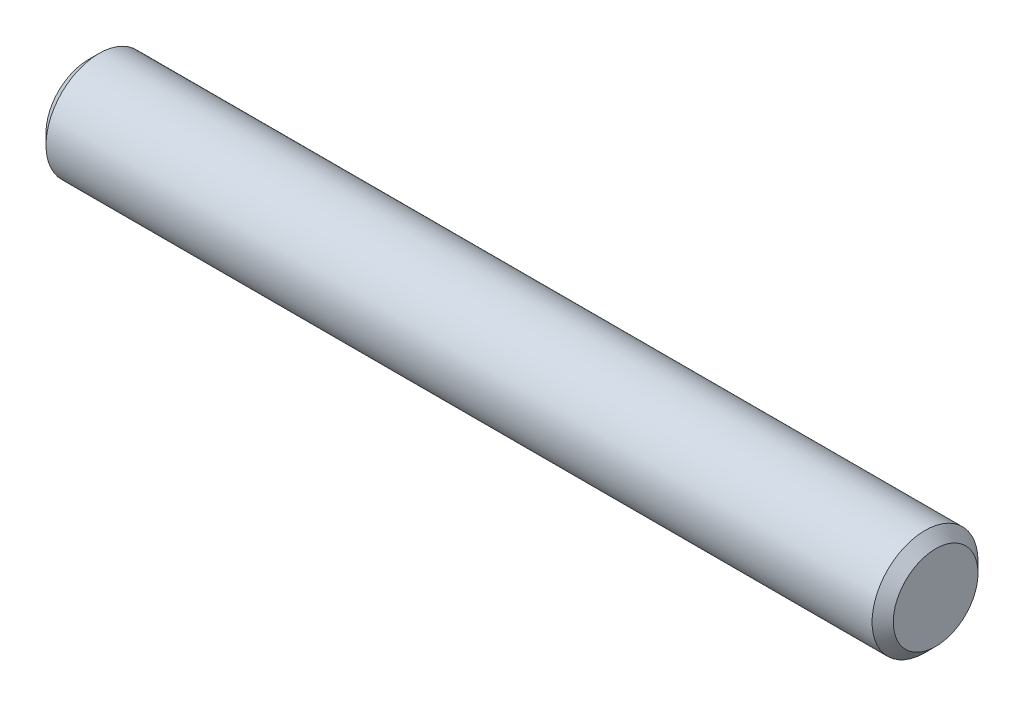
ISO-10303-21;
HEADER;
FILE_DESCRIPTION(('STEP AP214'),'2;1');
FILE_NAME('part.step','',(''),(''),'','','');
FILE_SCHEMA(('AUTOMOTIVE_DESIGN { 1 0 10303 214 1 1 1 1 }'));
ENDSEC;
DATA;
#1=APPLICATION_CONTEXT('core data for automotive mechanical design processes');
#2=APPLICATION_PROTOCOL_DEFINITION('international standard','automotive_design',2000,#1);
#3=PRODUCT_CONTEXT('',#1,'mechanical');
#4=PRODUCT('Part','Part','',(#3));
#5=PRODUCT_RELATED_PRODUCT_CATEGORY('part','',(#4));
#6=PRODUCT_DEFINITION_FORMATION('','',#4);
#7=PRODUCT_DEFINITION_CONTEXT('part definition',#1,'design');
#8=PRODUCT_DEFINITION('design','',#6,#7);
#9=PRODUCT_DEFINITION_SHAPE('','',#8);
#10=(LENGTH_UNIT() NAMED_UNIT(*) SI_UNIT(.MILLI.,.METRE.));
#11=(NAMED_UNIT(*) PLANE_ANGLE_UNIT() SI_UNIT($,.RADIAN.));
#12=(NAMED_UNIT(*) SI_UNIT($,.STERADIAN.) SOLID_ANGLE_UNIT());
#13=UNCERTAINTY_MEASURE_WITH_UNIT(LENGTH_MEASURE(1.E-05),#10,'distance_accuracy_value','');
#14=(GEOMETRIC_REPRESENTATION_CONTEXT(3) GLOBAL_UNCERTAINTY_ASSIGNED_CONTEXT((#13)) GLOBAL_UNIT_ASSIGNED_CONTEXT((#10,
#11,#12)) REPRESENTATION_CONTEXT('',''));
#15=CARTESIAN_POINT('',(0.,0.,0.));
#16=DIRECTION('',(0.,0.,1.));
#17=DIRECTION('',(1.,0.,0.));
#18=AXIS2_PLACEMENT_3D('',#15,#16,#17);
#19=CARTESIAN_POINT('',(-12.7,0.,0.));
#20=DIRECTION('',(1.,0.,0.));
#21=DIRECTION('',(0.,0.,-1.));
#22=AXIS2_PLACEMENT_3D('',#19,#20,#21);
#23=CYLINDRICAL_SURFACE('',#22,1.5875);
#24=CARTESIAN_POINT('',(12.3825,0.,0.));
#25=DIRECTION('',(1.,0.,0.));
#26=DIRECTION('',(0.,0.,-1.));
#27=AXIS2_PLACEMENT_3D('',#24,#25,#26);
#28=CIRCLE('',#27,1.5875);
#29=CARTESIAN_POINT('',(12.3825,0.,-1.5875));
#30=VERTEX_POINT('',#29);
#31=EDGE_CURVE('E44',#30,#30,#28,.F.);
#32=ORIENTED_EDGE('',*,*,#31,.T.);
#33=EDGE_LOOP('',(#32));
#34=FACE_BOUND('',#33,.T.);
#35=CARTESIAN_POINT('',(-12.3825,0.,0.));
#36=DIRECTION('',(1.,0.,0.));
#37=DIRECTION('',(0.,0.,-1.));
#38=AXIS2_PLACEMENT_3D('',#35,#36,#37);
#39=CIRCLE('',#38,1.5875);
#40=CARTESIAN_POINT('',(-12.3825,0.,-1.5875));
#41=VERTEX_POINT('',#40);
#42=EDGE_CURVE('E50',#41,#41,#39,.T.);
#43=ORIENTED_EDGE('',*,*,#42,.T.);
#44=EDGE_LOOP('',(#43));
#45=FACE_BOUND('',#44,.T.);
#46=ADVANCED_FACE('F36',(#34,#45),#23,.T.);
#47=CARTESIAN_POINT('',(-12.7,0.,0.));
#48=DIRECTION('',(1.,0.,0.));
#49=DIRECTION('',(0.,0.,-1.));
#50=AXIS2_PLACEMENT_3D('',#47,#48,#49);
#51=PLANE('',#50);
#52=CARTESIAN_POINT('',(-12.7,0.,0.));
#53=DIRECTION('',(1.,0.,0.));
#54=DIRECTION('',(0.,0.,-1.));
#55=AXIS2_PLACEMENT_3D('',#52,#53,#54);
#56=CIRCLE('',#55,1.26999999999999);
#57=CARTESIAN_POINT('',(-12.7,0.,-1.26999999999999));
#58=VERTEX_POINT('',#57);
#59=EDGE_CURVE('E10',#58,#58,#56,.F.);
#60=ORIENTED_EDGE('',*,*,#59,.T.);
#61=EDGE_LOOP('',(#60));
#62=FACE_BOUND('',#61,.T.);
#63=ADVANCED_FACE('F71',(#62),#51,.F.);
#64=CARTESIAN_POINT('',(12.7,0.,0.));
#65=DIRECTION('',(1.,0.,0.));
#66=DIRECTION('',(0.,0.,-1.));
#67=AXIS2_PLACEMENT_3D('',#64,#65,#66);
#68=PLANE('',#67);
#69=CARTESIAN_POINT('',(12.7,0.,0.));
#70=DIRECTION('',(1.,0.,0.));
#71=DIRECTION('',(0.,0.,-1.));
#72=AXIS2_PLACEMENT_3D('',#69,#70,#71);
#73=CIRCLE('',#72,1.27);
#74=CARTESIAN_POINT('',(12.7,0.,-1.27));
#75=VERTEX_POINT('',#74);
#76=EDGE_CURVE('E55',#75,#75,#73,.T.);
#77=ORIENTED_EDGE('',*,*,#76,.T.);
#78=EDGE_LOOP('',(#77));
#79=FACE_BOUND('',#78,.T.);
#80=ADVANCED_FACE('F61',(#79),#68,.T.);
#81=CARTESIAN_POINT('',(12.7,0.,0.));
#82=DIRECTION('',(-1.,0.,0.));
#83=DIRECTION('',(0.,0.,1.));
#84=AXIS2_PLACEMENT_3D('',#81,#82,#83);
#85=CONICAL_SURFACE('',#84,1.27,0.785398163397445);
#86=ORIENTED_EDGE('',*,*,#31,.F.);
#87=EDGE_LOOP('',(#86));
#88=FACE_BOUND('',#87,.T.);
#89=ORIENTED_EDGE('',*,*,#76,.F.);
#90=EDGE_LOOP('',(#89));
#91=FACE_BOUND('',#90,.T.);
#92=ADVANCED_FACE('F63',(#88,#91),#85,.T.);
#93=CARTESIAN_POINT('',(-12.3825,0.,0.));
#94=DIRECTION('',(1.,0.,0.));
#95=DIRECTION('',(0.,0.,-1.));
#96=AXIS2_PLACEMENT_3D('',#93,#94,#95);
#97=CONICAL_SURFACE('',#96,1.5875,0.78539816339745);
#98=ORIENTED_EDGE('',*,*,#59,.F.);
#99=EDGE_LOOP('',(#98));
#100=FACE_BOUND('',#99,.T.);
#101=ORIENTED_EDGE('',*,*,#42,.F.);
#102=EDGE_LOOP('',(#101));
#103=FACE_BOUND('',#102,.T.);
#104=ADVANCED_FACE('F38',(#100,#103),#97,.T.);
#105=CLOSED_SHELL('',(#46,#63,#80,#92,#104));
#106=MANIFOLD_SOLID_BREP('B2',#105);
#107=ADVANCED_BREP_SHAPE_REPRESENTATION('',(#18,#106),#14);
#108=SHAPE_DEFINITION_REPRESENTATION(#9,#107);
ENDSEC;
END-ISO-10303-21;
